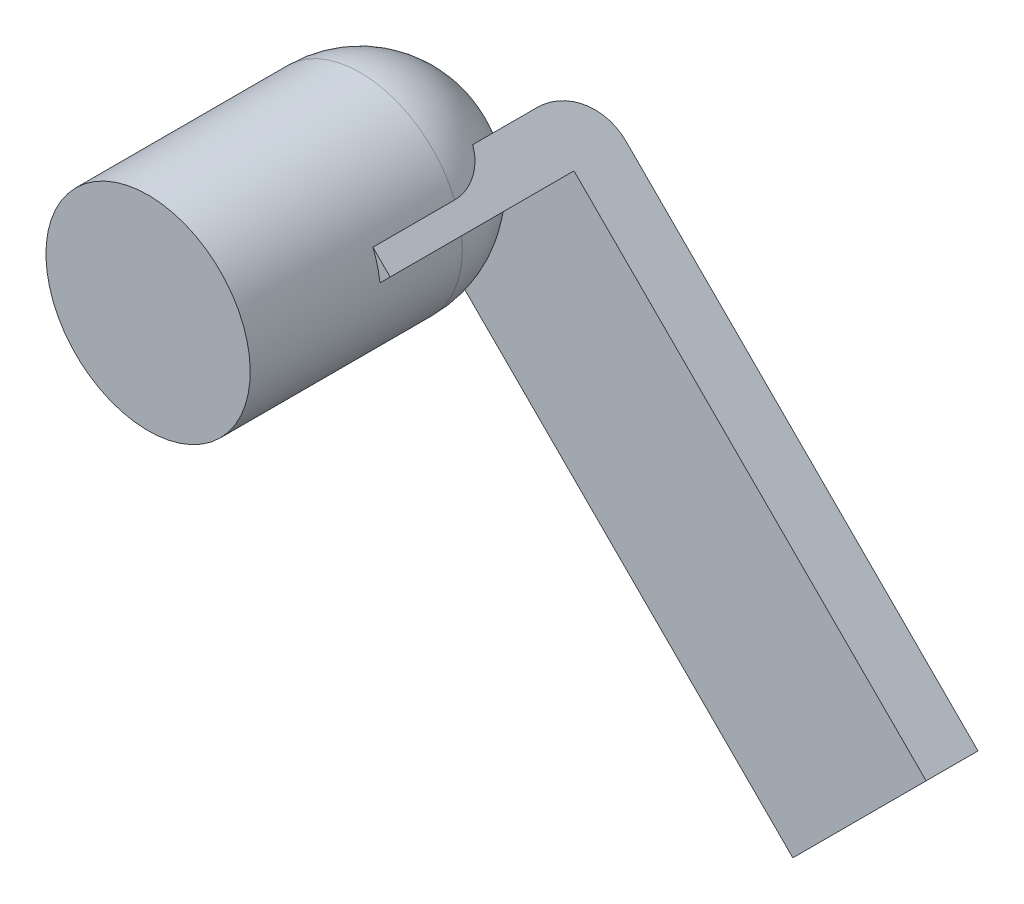
ISO-10303-21;
HEADER;
FILE_DESCRIPTION(('STEP AP214'),'2;1');
FILE_NAME('part.step','',(''),(''),'','','');
FILE_SCHEMA(('AUTOMOTIVE_DESIGN { 1 0 10303 214 1 1 1 1 }'));
ENDSEC;
DATA;
#1=APPLICATION_CONTEXT('core data for automotive mechanical design processes');
#2=APPLICATION_PROTOCOL_DEFINITION('international standard','automotive_design',2000,#1);
#3=PRODUCT_CONTEXT('',#1,'mechanical');
#4=PRODUCT('Part','Part','',(#3));
#5=PRODUCT_RELATED_PRODUCT_CATEGORY('part','',(#4));
#6=PRODUCT_DEFINITION_FORMATION('','',#4);
#7=PRODUCT_DEFINITION_CONTEXT('part definition',#1,'design');
#8=PRODUCT_DEFINITION('design','',#6,#7);
#9=PRODUCT_DEFINITION_SHAPE('','',#8);
#10=(LENGTH_UNIT() NAMED_UNIT(*) SI_UNIT(.MILLI.,.METRE.));
#11=(NAMED_UNIT(*) PLANE_ANGLE_UNIT() SI_UNIT($,.RADIAN.));
#12=(NAMED_UNIT(*) SI_UNIT($,.STERADIAN.) SOLID_ANGLE_UNIT());
#13=UNCERTAINTY_MEASURE_WITH_UNIT(LENGTH_MEASURE(1.E-05),#10,'distance_accuracy_value','');
#14=(GEOMETRIC_REPRESENTATION_CONTEXT(3) GLOBAL_UNCERTAINTY_ASSIGNED_CONTEXT((#13)) GLOBAL_UNIT_ASSIGNED_CONTEXT((#10,
#11,#12)) REPRESENTATION_CONTEXT('',''));
#15=CARTESIAN_POINT('',(0.,0.,0.));
#16=DIRECTION('',(0.,0.,1.));
#17=DIRECTION('',(1.,0.,0.));
#18=AXIS2_PLACEMENT_3D('',#15,#16,#17);
#19=CARTESIAN_POINT('',(-23.4287493030753,-12.0180746822321,4.380316059209));
#20=DIRECTION('',(3.09086344020721E-08,3.09086344020721E-08,1.));
#21=DIRECTION('',(0.707106781186547,0.707106781186547,-4.37114099658419E-08));
#22=AXIS2_PLACEMENT_3D('',#19,#20,#21);
#23=PLANE('',#22);
#24=CARTESIAN_POINT('',(-22.9691298953041,-12.4776940900034,4.380316059209));
#25=DIRECTION('',(-3.09086344020721E-08,-3.09086344020721E-08,-1.));
#26=DIRECTION('',(-0.707106781186548,0.707106781186548,0.));
#27=AXIS2_PLACEMENT_3D('',#24,#25,#26);
#28=CIRCLE('',#27,0.65);
#29=CARTESIAN_POINT('',(-23.4287493030754,-12.0180746822321,4.380316059209));
#30=VERTEX_POINT('',#29);
#31=EDGE_CURVE('E11',#30,#30,#28,.T.);
#32=ORIENTED_EDGE('',*,*,#31,.F.);
#33=EDGE_LOOP('',(#32));
#34=FACE_BOUND('',#33,.T.);
#35=ADVANCED_FACE('F17',(#34),#23,.T.);
#36=CARTESIAN_POINT('',(-22.9691299161675,-12.4776941108667,3.705316059209));
#37=DIRECTION('',(-3.09086344020721E-08,-3.09086344020721E-08,-1.));
#38=DIRECTION('',(-0.707106781186548,0.707106781186548,0.));
#39=AXIS2_PLACEMENT_3D('',#36,#37,#38);
#40=CYLINDRICAL_SURFACE('',#39,0.65);
#41=DIRECTION('',(-3.09086344020721E-08,-3.09086344020721E-08,-1.));
#42=VECTOR('',#41,1.);
#43=CARTESIAN_POINT('',(-22.3680891521589,-12.2302067374514,3.70531603298216));
#44=LINE('',#43,#42);
#45=CARTESIAN_POINT('',(-22.3680891569498,-12.2302067422423,3.55031603298215));
#46=VERTEX_POINT('',#45);
#47=CARTESIAN_POINT('',(-22.3680891730222,-12.2302067583148,3.03031603298215));
#48=VERTEX_POINT('',#47);
#49=EDGE_CURVE('E147',#46,#48,#44,.T.);
#50=ORIENTED_EDGE('',*,*,#49,.T.);
#51=CARTESIAN_POINT('',(-22.9691299370308,-12.4776941317301,3.030316059209));
#52=DIRECTION('',(-3.09086344020721E-08,-3.09086344020721E-08,-1.));
#53=DIRECTION('',(-0.707106781186548,0.707106781186548,0.));
#54=AXIS2_PLACEMENT_3D('',#51,#52,#53);
#55=CIRCLE('',#54,0.65);
#56=CARTESIAN_POINT('',(-23.2166173104461,-13.0787348957386,3.03031608543585));
#57=VERTEX_POINT('',#56);
#58=EDGE_CURVE('E26',#57,#48,#55,.T.);
#59=ORIENTED_EDGE('',*,*,#58,.F.);
#60=DIRECTION('',(3.09086344020721E-08,3.09086344020721E-08,1.));
#61=VECTOR('',#60,1.);
#62=CARTESIAN_POINT('',(-23.2166172895828,-13.0787348748753,3.70531608543585));
#63=LINE('',#62,#61);
#64=CARTESIAN_POINT('',(-23.2166172943736,-13.0787348796661,3.55031608543585));
#65=VERTEX_POINT('',#64);
#66=EDGE_CURVE('E159',#57,#65,#63,.T.);
#67=ORIENTED_EDGE('',*,*,#66,.T.);
#68=CARTESIAN_POINT('',(-22.9691299209583,-12.4776941156576,3.550316059209));
#69=DIRECTION('',(3.09086344020721E-08,3.09086344020721E-08,1.));
#70=DIRECTION('',(-0.707106781186548,0.707106781186548,0.));
#71=AXIS2_PLACEMENT_3D('',#68,#69,#70);
#72=CIRCLE('',#71,0.65);
#73=CARTESIAN_POINT('',(-23.042247849801,-13.1235685372614,3.55031608143207));
#74=VERTEX_POINT('',#73);
#75=EDGE_CURVE('E38',#65,#74,#72,.T.);
#76=ORIENTED_EDGE('',*,*,#75,.T.);
#77=DIRECTION('',(-3.09086344020721E-08,-3.09086344020721E-08,-1.));
#78=VECTOR('',#77,1.);
#79=CARTESIAN_POINT('',(-23.0422478450101,-13.1235685324706,3.70531608143207));
#80=LINE('',#79,#78);
#81=CARTESIAN_POINT('',(-23.0422478658735,-13.1235685533339,3.03031608143207));
#82=VERTEX_POINT('',#81);
#83=EDGE_CURVE('E165',#74,#82,#80,.T.);
#84=ORIENTED_EDGE('',*,*,#83,.T.);
#85=CARTESIAN_POINT('',(-22.323255515427,-12.4045762028873,3.03031603698593));
#86=VERTEX_POINT('',#85);
#87=EDGE_CURVE('E186',#86,#82,#55,.T.);
#88=ORIENTED_EDGE('',*,*,#87,.F.);
#89=DIRECTION('',(3.09086344020721E-08,3.09086344020721E-08,1.));
#90=VECTOR('',#89,1.);
#91=CARTESIAN_POINT('',(-22.3232554945636,-12.404576182024,3.70531603698593));
#92=LINE('',#91,#90);
#93=CARTESIAN_POINT('',(-22.3232554993544,-12.4045761868149,3.55031603698593));
#94=VERTEX_POINT('',#93);
#95=EDGE_CURVE('E209',#86,#94,#92,.T.);
#96=ORIENTED_EDGE('',*,*,#95,.T.);
#97=EDGE_CURVE('E214',#94,#46,#72,.T.);
#98=ORIENTED_EDGE('',*,*,#97,.T.);
#99=EDGE_LOOP('',(#50,#59,#67,#76,#84,#88,#96,#98));
#100=FACE_BOUND('',#99,.T.);
#101=ORIENTED_EDGE('',*,*,#31,.T.);
#102=EDGE_LOOP('',(#101));
#103=FACE_BOUND('',#102,.T.);
#104=ADVANCED_FACE('F274',(#100,#103),#40,.T.);
#105=CARTESIAN_POINT('',(-22.9691299370308,-12.4776941317301,3.030316059209));
#106=DIRECTION('',(3.09086343587743E-08,3.09086343587743E-08,1.));
#107=DIRECTION('',(-0.707106781186547,-0.707106781186547,4.37114099046096E-08));
#108=AXIS2_PLACEMENT_3D('',#105,#106,#107);
#109=SPHERICAL_SURFACE('',#108,0.65);
#110=ORIENTED_EDGE('',*,*,#58,.T.);
#111=CARTESIAN_POINT('',(-22.5448658683189,-12.0534300630181,3.03031603298215));
#112=DIRECTION('',(0.707106781186547,0.707106781186547,-4.37114099658419E-08));
#113=DIRECTION('',(3.09086344020721E-08,3.09086344020721E-08,1.));
#114=AXIS2_PLACEMENT_3D('',#111,#112,#113);
#115=CIRCLE('',#114,0.25);
#116=CARTESIAN_POINT('',(-22.4918328671011,-12.1064630789784,2.79183123262816));
#117=VERTEX_POINT('',#116);
#118=EDGE_CURVE('E229',#48,#117,#115,.T.);
#119=ORIENTED_EDGE('',*,*,#118,.T.);
#120=CARTESIAN_POINT('',(-22.9160969284418,-12.530727140319,3.030316059209));
#121=DIRECTION('',(-0.707106781186548,0.707106781186548,0.));
#122=DIRECTION('',(0.707106781186547,0.707106781186547,-4.37114099658419E-08));
#123=AXIS2_PLACEMENT_3D('',#120,#121,#122);
#124=CIRCLE('',#123,0.645658578507);
#125=CARTESIAN_POINT('',(-23.340361004525,-12.9549912164022,2.79183128508185));
#126=VERTEX_POINT('',#125);
#127=EDGE_CURVE('E235',#117,#126,#124,.T.);
#128=ORIENTED_EDGE('',*,*,#127,.T.);
#129=CARTESIAN_POINT('',(-23.3933940057427,-12.901958200442,3.03031608543585));
#130=DIRECTION('',(-0.707106781186547,-0.707106781186547,4.37114099658419E-08));
#131=DIRECTION('',(-3.09086344020721E-08,-3.09086344020721E-08,-1.));
#132=AXIS2_PLACEMENT_3D('',#129,#130,#131);
#133=CIRCLE('',#132,0.25);
#134=EDGE_CURVE('E232',#126,#57,#133,.T.);
#135=ORIENTED_EDGE('',*,*,#134,.T.);
#136=EDGE_LOOP('',(#110,#119,#128,#135));
#137=FACE_BOUND('',#136,.T.);
#138=ADVANCED_FACE('F280',(#137),#109,.T.);
#139=CARTESIAN_POINT('',(-22.6827516906502,-12.7640723781106,3.030316059209));
#140=DIRECTION('',(0.707106781186548,-0.707106781186548,0.));
#141=DIRECTION('',(-0.707106781186547,-0.707106781186547,4.37114099658419E-08));
#142=AXIS2_PLACEMENT_3D('',#139,#140,#141);
#143=CIRCLE('',#142,0.508404366622);
#144=EDGE_CURVE('E223',#82,#86,#143,.T.);
#145=ORIENTED_EDGE('',*,*,#144,.T.);
#146=ORIENTED_EDGE('',*,*,#87,.T.);
#147=EDGE_LOOP('',(#145,#146));
#148=FACE_BOUND('',#147,.T.);
#149=ADVANCED_FACE('F277',(#148),#109,.T.);
#150=CARTESIAN_POINT('',(-20.4412232245793,-15.0056009047625,2.05031605920901));
#151=DIRECTION('',(-3.09086344020721E-08,-3.09086344020721E-08,-1.));
#152=DIRECTION('',(-0.707106781186548,0.707106781186548,0.));
#153=AXIS2_PLACEMENT_3D('',#150,#151,#152);
#154=PLANE('',#153);
#155=DIRECTION('',(-0.707106781186547,-0.707106781186547,4.37114099658419E-08));
#156=VECTOR('',#155,1.);
#157=CARTESIAN_POINT('',(-22.6827517209407,-12.7640724084011,2.05031605920901));
#158=LINE('',#157,#156);
#159=CARTESIAN_POINT('',(-22.2584876522288,-12.3398083396891,2.05031603298215));
#160=VERTEX_POINT('',#159);
#161=CARTESIAN_POINT('',(-23.1070157896526,-13.188336477113,2.05031608543585));
#162=VERTEX_POINT('',#161);
#163=EDGE_CURVE('E198',#160,#162,#158,.T.);
#164=ORIENTED_EDGE('',*,*,#163,.F.);
#165=DIRECTION('',(-0.707106781186548,0.707106781186548,0.));
#166=VECTOR('',#165,1.);
#167=CARTESIAN_POINT('',(-20.0169591558674,-14.5813368360505,2.05031603298215));
#168=LINE('',#167,#166);
#169=CARTESIAN_POINT('',(-20.0169591558674,-14.5813368360505,2.05031603298215));
#170=VERTEX_POINT('',#169);
#171=EDGE_CURVE('E173',#170,#160,#168,.T.);
#172=ORIENTED_EDGE('',*,*,#171,.F.);
#173=DIRECTION('',(-0.707106781186547,-0.707106781186547,4.37114099658419E-08));
#174=VECTOR('',#173,1.);
#175=CARTESIAN_POINT('',(-20.4412232245793,-15.0056009047625,2.05031605920901));
#176=LINE('',#175,#174);
#177=CARTESIAN_POINT('',(-20.8654872932913,-15.4298649734744,2.05031608543585));
#178=VERTEX_POINT('',#177);
#179=EDGE_CURVE('E187',#170,#178,#176,.T.);
#180=ORIENTED_EDGE('',*,*,#179,.T.);
#181=DIRECTION('',(0.707106781186548,-0.707106781186548,0.));
#182=VECTOR('',#181,1.);
#183=CARTESIAN_POINT('',(-20.8654872932913,-15.4298649734744,2.05031608543585));
#184=LINE('',#183,#182);
#185=EDGE_CURVE('E181',#162,#178,#184,.T.);
#186=ORIENTED_EDGE('',*,*,#185,.F.);
#187=EDGE_LOOP('',(#164,#172,#180,#186));
#188=FACE_BOUND('',#187,.T.);
#189=ADVANCED_FACE('F279',(#188),#154,.T.);
#190=CARTESIAN_POINT('',(-22.6827517107408,-12.7640723982012,2.38031605920901));
#191=DIRECTION('',(3.09086348199792E-08,3.0908633984165E-08,1.));
#192=DIRECTION('',(0.707106781186548,-0.707106781186548,0.));
#193=AXIS2_PLACEMENT_3D('',#190,#191,#192);
#194=PLANE('',#193);
#195=DIRECTION('',(0.707106781186547,0.707106781186547,-4.37114099658419E-08));
#196=VECTOR('',#195,1.);
#197=CARTESIAN_POINT('',(-20.4412232143795,-15.0056008945626,2.38031605920901));
#198=LINE('',#197,#196);
#199=CARTESIAN_POINT('',(-20.8654872830914,-15.4298649632745,2.38031608543585));
#200=VERTEX_POINT('',#199);
#201=CARTESIAN_POINT('',(-20.0169591456675,-14.5813368258506,2.38031603298216));
#202=VERTEX_POINT('',#201);
#203=EDGE_CURVE('E131',#200,#202,#198,.T.);
#204=ORIENTED_EDGE('',*,*,#203,.T.);
#205=DIRECTION('',(0.707106781186548,-0.707106781186548,0.));
#206=VECTOR('',#205,1.);
#207=CARTESIAN_POINT('',(-22.2584876420289,-12.3398083294893,2.38031603298216));
#208=LINE('',#207,#206);
#209=CARTESIAN_POINT('',(-22.2584876420289,-12.3398083294893,2.38031603298216));
#210=VERTEX_POINT('',#209);
#211=EDGE_CURVE('E129',#210,#202,#208,.T.);
#212=ORIENTED_EDGE('',*,*,#211,.F.);
#213=DIRECTION('',(0.707106781186547,0.707106781186547,-4.37114099658419E-08));
#214=VECTOR('',#213,1.);
#215=CARTESIAN_POINT('',(-22.6827517107408,-12.7640723982012,2.38031605920901));
#216=LINE('',#215,#214);
#217=CARTESIAN_POINT('',(-23.1070157794528,-13.1883364669132,2.38031608543585));
#218=VERTEX_POINT('',#217);
#219=EDGE_CURVE('E112',#218,#210,#216,.T.);
#220=ORIENTED_EDGE('',*,*,#219,.F.);
#221=DIRECTION('',(-0.707106781186548,0.707106781186548,0.));
#222=VECTOR('',#221,1.);
#223=CARTESIAN_POINT('',(-23.1070157794528,-13.1883364669132,2.38031608543585));
#224=LINE('',#223,#222);
#225=EDGE_CURVE('E180',#200,#218,#224,.T.);
#226=ORIENTED_EDGE('',*,*,#225,.F.);
#227=EDGE_LOOP('',(#204,#212,#220,#226));
#228=FACE_BOUND('',#227,.T.);
#229=ADVANCED_FACE('F130',(#228),#194,.T.);
#230=CARTESIAN_POINT('',(-20.4412232143795,-15.0056008945626,2.38031605920901));
#231=DIRECTION('',(0.707106781186548,-0.707106781186548,0.));
#232=DIRECTION('',(-3.09086344020721E-08,-3.09086344020721E-08,-1.));
#233=AXIS2_PLACEMENT_3D('',#230,#231,#232);
#234=PLANE('',#233);
#235=ORIENTED_EDGE('',*,*,#179,.F.);
#236=DIRECTION('',(-3.09086344020721E-08,-3.09086344020721E-08,-1.));
#237=VECTOR('',#236,1.);
#238=CARTESIAN_POINT('',(-20.0169591456675,-14.5813368258506,2.38031603298216));
#239=LINE('',#238,#237);
#240=EDGE_CURVE('E136',#202,#170,#239,.T.);
#241=ORIENTED_EDGE('',*,*,#240,.F.);
#242=ORIENTED_EDGE('',*,*,#203,.F.);
#243=DIRECTION('',(3.09086344020721E-08,3.09086344020721E-08,1.));
#244=VECTOR('',#243,1.);
#245=CARTESIAN_POINT('',(-20.8654872830914,-15.4298649632745,2.38031608543585));
#246=LINE('',#245,#244);
#247=EDGE_CURVE('E176',#178,#200,#246,.T.);
#248=ORIENTED_EDGE('',*,*,#247,.F.);
#249=EDGE_LOOP('',(#235,#241,#242,#248));
#250=FACE_BOUND('',#249,.T.);
#251=ADVANCED_FACE('F328',(#250),#234,.T.);
#252=CARTESIAN_POINT('',(-22.9160969123693,-12.5307271242466,3.550316059209));
#253=DIRECTION('',(3.09086344020721E-08,3.09086344020721E-08,1.));
#254=DIRECTION('',(0.707106781186548,-0.707106781186548,0.));
#255=AXIS2_PLACEMENT_3D('',#252,#253,#254);
#256=PLANE('',#255);
#257=ORIENTED_EDGE('',*,*,#97,.F.);
#258=DIRECTION('',(0.707106781186547,0.707106781186547,-4.37114099658419E-08));
#259=VECTOR('',#258,1.);
#260=CARTESIAN_POINT('',(-22.6827516745777,-12.7640723620381,3.550316059209));
#261=LINE('',#260,#259);
#262=CARTESIAN_POINT('',(-22.2584876058658,-12.3398082933262,3.55031603298215));
#263=VERTEX_POINT('',#262);
#264=EDGE_CURVE('E126',#94,#263,#261,.T.);
#265=ORIENTED_EDGE('',*,*,#264,.T.);
#266=DIRECTION('',(0.707106781186548,-0.707106781186548,0.));
#267=VECTOR('',#266,1.);
#268=CARTESIAN_POINT('',(-22.4918328436573,-12.1064630555346,3.55031603298215));
#269=LINE('',#268,#267);
#270=EDGE_CURVE('E142',#46,#263,#269,.T.);
#271=ORIENTED_EDGE('',*,*,#270,.F.);
#272=EDGE_LOOP('',(#257,#265,#271));
#273=FACE_BOUND('',#272,.T.);
#274=ADVANCED_FACE('F338',(#273),#256,.T.);
#275=ORIENTED_EDGE('',*,*,#75,.F.);
#276=DIRECTION('',(-0.707106781186548,0.707106781186548,0.));
#277=VECTOR('',#276,1.);
#278=CARTESIAN_POINT('',(-23.3403609810812,-12.9549911929585,3.55031608543585));
#279=LINE('',#278,#277);
#280=CARTESIAN_POINT('',(-23.1070157432897,-13.1883364307501,3.55031608543585));
#281=VERTEX_POINT('',#280);
#282=EDGE_CURVE('E155',#281,#65,#279,.T.);
#283=ORIENTED_EDGE('',*,*,#282,.F.);
#284=EDGE_CURVE('E101',#281,#74,#261,.T.);
#285=ORIENTED_EDGE('',*,*,#284,.T.);
#286=EDGE_LOOP('',(#275,#283,#285));
#287=FACE_BOUND('',#286,.T.);
#288=ADVANCED_FACE('F349',(#287),#256,.T.);
#289=CARTESIAN_POINT('',(-22.6827516745777,-12.7640723620381,3.550316059209));
#290=DIRECTION('',(0.707106781186548,-0.707106781186548,0.));
#291=DIRECTION('',(-3.09086347794981E-08,-3.0908634024646E-08,-1.));
#292=AXIS2_PLACEMENT_3D('',#289,#290,#291);
#293=PLANE('',#292);
#294=ORIENTED_EDGE('',*,*,#95,.F.);
#295=ORIENTED_EDGE('',*,*,#144,.F.);
#296=ORIENTED_EDGE('',*,*,#83,.F.);
#297=ORIENTED_EDGE('',*,*,#284,.F.);
#298=DIRECTION('',(3.09086347794981E-08,3.0908634024646E-08,1.));
#299=VECTOR('',#298,1.);
#300=CARTESIAN_POINT('',(-23.1070157432897,-13.1883364307501,3.55031608543585));
#301=LINE('',#300,#299);
#302=EDGE_CURVE('E121',#218,#281,#301,.T.);
#303=ORIENTED_EDGE('',*,*,#302,.F.);
#304=ORIENTED_EDGE('',*,*,#219,.T.);
#305=DIRECTION('',(-3.09086347794981E-08,-3.0908634024646E-08,-1.));
#306=VECTOR('',#305,1.);
#307=CARTESIAN_POINT('',(-22.2584876058658,-12.3398082933262,3.55031603298215));
#308=LINE('',#307,#306);
#309=EDGE_CURVE('E118',#263,#210,#308,.T.);
#310=ORIENTED_EDGE('',*,*,#309,.F.);
#311=ORIENTED_EDGE('',*,*,#264,.F.);
#312=EDGE_LOOP('',(#294,#295,#296,#297,#303,#304,#310,#311));
#313=FACE_BOUND('',#312,.T.);
#314=ADVANCED_FACE('F115',(#313),#293,.T.);
#315=CARTESIAN_POINT('',(-21.5166548453004,-13.081641123182,2.42942603298216));
#316=DIRECTION('',(0.707106781186547,0.707106781186547,-4.37114099658419E-08));
#317=DIRECTION('',(-0.707106781186548,0.707106781186548,0.));
#318=AXIS2_PLACEMENT_3D('',#315,#316,#317);
#319=PLANE('',#318);
#320=CARTESIAN_POINT('',(-22.2584876420289,-12.3398083294893,2.38031603298216));
#321=DIRECTION('',(-0.707106781186547,-0.707106781186547,4.37114099658419E-08));
#322=DIRECTION('',(-0.500000021855705,0.499999978144295,-0.707106781186548));
#323=AXIS2_PLACEMENT_3D('',#320,#321,#322);
#324=CIRCLE('',#323,0.33);
#325=CARTESIAN_POINT('',(-22.4918328798204,-12.1064630916977,2.38031603298216));
#326=VERTEX_POINT('',#325);
#327=EDGE_CURVE('E203',#326,#160,#324,.T.);
#328=ORIENTED_EDGE('',*,*,#327,.F.);
#329=DIRECTION('',(3.09086346637542E-08,3.090863414039E-08,1.));
#330=VECTOR('',#329,1.);
#331=CARTESIAN_POINT('',(-22.4918328900203,-12.1064631018976,2.05031603298215));
#332=LINE('',#331,#330);
#333=EDGE_CURVE('E220',#326,#117,#332,.T.);
#334=ORIENTED_EDGE('',*,*,#333,.T.);
#335=ORIENTED_EDGE('',*,*,#118,.F.);
#336=ORIENTED_EDGE('',*,*,#49,.F.);
#337=ORIENTED_EDGE('',*,*,#270,.T.);
#338=ORIENTED_EDGE('',*,*,#309,.T.);
#339=ORIENTED_EDGE('',*,*,#211,.T.);
#340=ORIENTED_EDGE('',*,*,#240,.T.);
#341=ORIENTED_EDGE('',*,*,#171,.T.);
#342=EDGE_LOOP('',(#328,#334,#335,#336,#337,#338,#339,#340,#341));
#343=FACE_BOUND('',#342,.T.);
#344=ADVANCED_FACE('F139',(#343),#319,.T.);
#345=CARTESIAN_POINT('',(-22.3651829827242,-13.9301692606058,2.42942608543585));
#346=DIRECTION('',(-0.707106781186547,-0.707106781186547,4.37114099658419E-08));
#347=DIRECTION('',(0.707106781186548,-0.707106781186548,0.));
#348=AXIS2_PLACEMENT_3D('',#345,#346,#347);
#349=PLANE('',#348);
#350=CARTESIAN_POINT('',(-23.1070157794528,-13.1883364669132,2.38031608543585));
#351=DIRECTION('',(0.707106781186547,0.707106781186547,-4.37114099658419E-08));
#352=DIRECTION('',(-0.500000021855705,0.499999978144295,-0.707106781186548));
#353=AXIS2_PLACEMENT_3D('',#350,#351,#352);
#354=CIRCLE('',#353,0.33);
#355=CARTESIAN_POINT('',(-23.3403610172443,-12.9549912291216,2.38031608543585));
#356=VERTEX_POINT('',#355);
#357=EDGE_CURVE('E202',#162,#356,#354,.T.);
#358=ORIENTED_EDGE('',*,*,#357,.F.);
#359=ORIENTED_EDGE('',*,*,#185,.T.);
#360=ORIENTED_EDGE('',*,*,#247,.T.);
#361=ORIENTED_EDGE('',*,*,#225,.T.);
#362=ORIENTED_EDGE('',*,*,#302,.T.);
#363=ORIENTED_EDGE('',*,*,#282,.T.);
#364=ORIENTED_EDGE('',*,*,#66,.F.);
#365=ORIENTED_EDGE('',*,*,#134,.F.);
#366=DIRECTION('',(-3.09086346637542E-08,-3.090863414039E-08,-1.));
#367=VECTOR('',#366,1.);
#368=CARTESIAN_POINT('',(-23.3403610274442,-12.9549912393214,2.05031608543585));
#369=LINE('',#368,#367);
#370=EDGE_CURVE('E239',#126,#356,#369,.T.);
#371=ORIENTED_EDGE('',*,*,#370,.T.);
#372=EDGE_LOOP('',(#358,#359,#360,#361,#362,#363,#364,#365,#371));
#373=FACE_BOUND('',#372,.T.);
#374=ADVANCED_FACE('F377',(#373),#349,.T.);
#375=CARTESIAN_POINT('',(-22.9160969587323,-12.5307271706095,2.05031605920901));
#376=DIRECTION('',(-0.707106781186548,0.707106781186548,0.));
#377=DIRECTION('',(3.09086346637542E-08,3.090863414039E-08,1.));
#378=AXIS2_PLACEMENT_3D('',#375,#376,#377);
#379=PLANE('',#378);
#380=DIRECTION('',(0.707106781186547,0.707106781186547,-4.37114099658419E-08));
#381=VECTOR('',#380,1.);
#382=CARTESIAN_POINT('',(-22.9160969485324,-12.5307271604097,2.38031605920901));
#383=LINE('',#382,#381);
#384=EDGE_CURVE('E495',#356,#326,#383,.T.);
#385=ORIENTED_EDGE('',*,*,#384,.F.);
#386=ORIENTED_EDGE('',*,*,#370,.F.);
#387=ORIENTED_EDGE('',*,*,#127,.F.);
#388=ORIENTED_EDGE('',*,*,#333,.F.);
#389=EDGE_LOOP('',(#385,#386,#387,#388));
#390=FACE_BOUND('',#389,.T.);
#391=ADVANCED_FACE('F387',(#390),#379,.T.);
#392=CARTESIAN_POINT('',(-22.6827517107408,-12.7640723982012,2.38031605920901));
#393=DIRECTION('',(0.707106781186547,0.707106781186547,-4.37114099658419E-08));
#394=DIRECTION('',(-0.500000021855705,0.499999978144295,-0.707106781186548));
#395=AXIS2_PLACEMENT_3D('',#392,#393,#394);
#396=CYLINDRICAL_SURFACE('',#395,0.33);
#397=ORIENTED_EDGE('',*,*,#327,.T.);
#398=ORIENTED_EDGE('',*,*,#163,.T.);
#399=ORIENTED_EDGE('',*,*,#357,.T.);
#400=ORIENTED_EDGE('',*,*,#384,.T.);
#401=EDGE_LOOP('',(#397,#398,#399,#400));
#402=FACE_BOUND('',#401,.T.);
#403=ADVANCED_FACE('F398',(#402),#396,.T.);
#404=CLOSED_SHELL('',(#35,#104,#138,#149,#189,#229,#251,#274,#288,#314,#344,#374,#391,#403));
#405=MANIFOLD_SOLID_BREP('B1',#404);
#406=ADVANCED_BREP_SHAPE_REPRESENTATION('',(#18,#405),#14);
#407=SHAPE_DEFINITION_REPRESENTATION(#9,#406);
ENDSEC;
END-ISO-10303-21;
